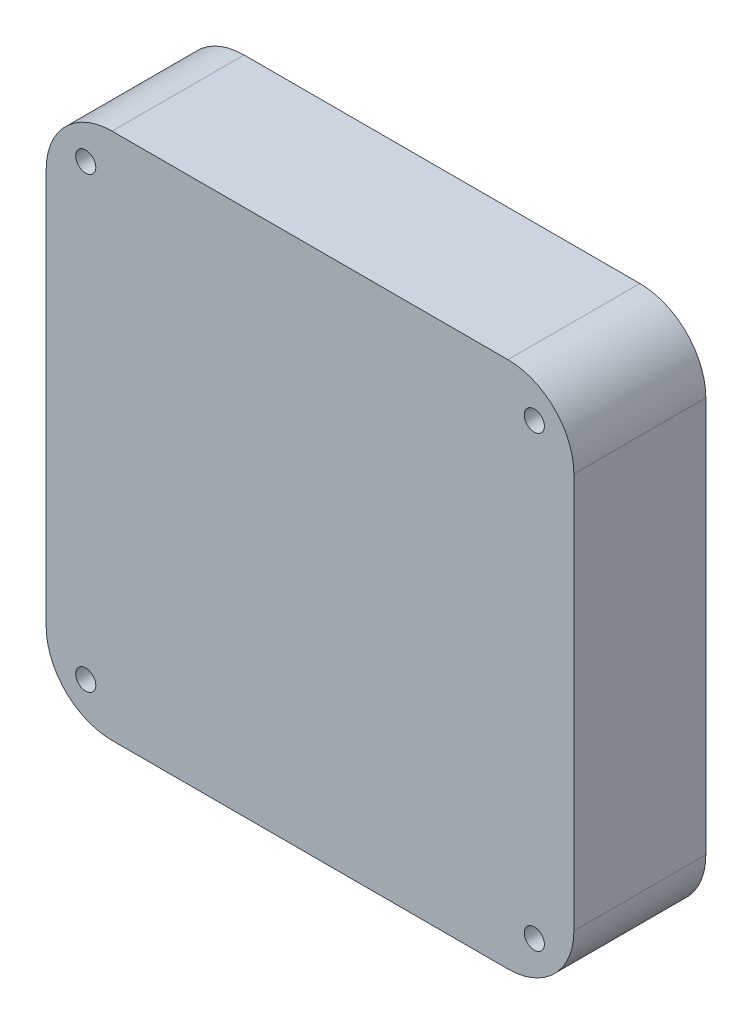
ISO-10303-21;
HEADER;
FILE_DESCRIPTION(('STEP AP214'),'2;1');
FILE_NAME('part.step','',(''),(''),'','','');
FILE_SCHEMA(('AUTOMOTIVE_DESIGN { 1 0 10303 214 1 1 1 1 }'));
ENDSEC;
DATA;
#1=APPLICATION_CONTEXT('core data for automotive mechanical design processes');
#2=APPLICATION_PROTOCOL_DEFINITION('international standard','automotive_design',2000,#1);
#3=PRODUCT_CONTEXT('',#1,'mechanical');
#4=PRODUCT('Part','Part','',(#3));
#5=PRODUCT_RELATED_PRODUCT_CATEGORY('part','',(#4));
#6=PRODUCT_DEFINITION_FORMATION('','',#4);
#7=PRODUCT_DEFINITION_CONTEXT('part definition',#1,'design');
#8=PRODUCT_DEFINITION('design','',#6,#7);
#9=PRODUCT_DEFINITION_SHAPE('','',#8);
#10=(LENGTH_UNIT() NAMED_UNIT(*) SI_UNIT(.MILLI.,.METRE.));
#11=(NAMED_UNIT(*) PLANE_ANGLE_UNIT() SI_UNIT($,.RADIAN.));
#12=(NAMED_UNIT(*) SI_UNIT($,.STERADIAN.) SOLID_ANGLE_UNIT());
#13=UNCERTAINTY_MEASURE_WITH_UNIT(LENGTH_MEASURE(1.E-05),#10,'distance_accuracy_value','');
#14=(GEOMETRIC_REPRESENTATION_CONTEXT(3) GLOBAL_UNCERTAINTY_ASSIGNED_CONTEXT((#13)) GLOBAL_UNIT_ASSIGNED_CONTEXT((#10,
#11,#12)) REPRESENTATION_CONTEXT('',''));
#15=CARTESIAN_POINT('',(0.,0.,0.));
#16=DIRECTION('',(0.,0.,1.));
#17=DIRECTION('',(1.,0.,0.));
#18=AXIS2_PLACEMENT_3D('',#15,#16,#17);
#19=CARTESIAN_POINT('',(0.,0.,10.));
#20=DIRECTION('',(1.,0.,0.));
#21=DIRECTION('',(0.,0.,-1.));
#22=AXIS2_PLACEMENT_3D('',#19,#20,#21);
#23=PLANE('',#22);
#24=DIRECTION('',(0.,-1.,0.));
#25=VECTOR('',#24,1.);
#26=CARTESIAN_POINT('',(0.,0.,0.));
#27=LINE('',#26,#25);
#28=CARTESIAN_POINT('',(0.,35.,0.));
#29=VERTEX_POINT('',#28);
#30=CARTESIAN_POINT('',(0.,5.,0.));
#31=VERTEX_POINT('',#30);
#32=EDGE_CURVE('E160',#29,#31,#27,.T.);
#33=ORIENTED_EDGE('',*,*,#32,.T.);
#34=DIRECTION('',(0.,0.,-1.));
#35=VECTOR('',#34,1.);
#36=CARTESIAN_POINT('',(0.,5.,10.));
#37=LINE('',#36,#35);
#38=CARTESIAN_POINT('',(0.,5.,10.));
#39=VERTEX_POINT('',#38);
#40=EDGE_CURVE('E11',#31,#39,#37,.F.);
#41=ORIENTED_EDGE('',*,*,#40,.T.);
#42=DIRECTION('',(0.,-1.,0.));
#43=VECTOR('',#42,1.);
#44=CARTESIAN_POINT('',(0.,0.,10.));
#45=LINE('',#44,#43);
#46=CARTESIAN_POINT('',(0.,35.,10.));
#47=VERTEX_POINT('',#46);
#48=EDGE_CURVE('E128',#47,#39,#45,.T.);
#49=ORIENTED_EDGE('',*,*,#48,.F.);
#50=DIRECTION('',(0.,0.,-1.));
#51=VECTOR('',#50,1.);
#52=CARTESIAN_POINT('',(0.,35.,10.));
#53=LINE('',#52,#51);
#54=EDGE_CURVE('E44',#47,#29,#53,.T.);
#55=ORIENTED_EDGE('',*,*,#54,.T.);
#56=EDGE_LOOP('',(#33,#41,#49,#55));
#57=FACE_BOUND('',#56,.T.);
#58=ADVANCED_FACE('F36',(#57),#23,.F.);
#59=CARTESIAN_POINT('',(0.,0.,10.));
#60=DIRECTION('',(0.,1.,0.));
#61=DIRECTION('',(0.,0.,1.));
#62=AXIS2_PLACEMENT_3D('',#59,#60,#61);
#63=PLANE('',#62);
#64=DIRECTION('',(1.,0.,0.));
#65=VECTOR('',#64,1.);
#66=CARTESIAN_POINT('',(0.,0.,0.));
#67=LINE('',#66,#65);
#68=CARTESIAN_POINT('',(5.,0.,0.));
#69=VERTEX_POINT('',#68);
#70=CARTESIAN_POINT('',(35.,0.,0.));
#71=VERTEX_POINT('',#70);
#72=EDGE_CURVE('E133',#69,#71,#67,.T.);
#73=ORIENTED_EDGE('',*,*,#72,.T.);
#74=DIRECTION('',(0.,0.,-1.));
#75=VECTOR('',#74,1.);
#76=CARTESIAN_POINT('',(35.,0.,10.));
#77=LINE('',#76,#75);
#78=CARTESIAN_POINT('',(35.,0.,10.));
#79=VERTEX_POINT('',#78);
#80=EDGE_CURVE('E51',#71,#79,#77,.F.);
#81=ORIENTED_EDGE('',*,*,#80,.T.);
#82=DIRECTION('',(1.,0.,0.));
#83=VECTOR('',#82,1.);
#84=CARTESIAN_POINT('',(0.,0.,10.));
#85=LINE('',#84,#83);
#86=CARTESIAN_POINT('',(5.,0.,10.));
#87=VERTEX_POINT('',#86);
#88=EDGE_CURVE('E131',#87,#79,#85,.T.);
#89=ORIENTED_EDGE('',*,*,#88,.F.);
#90=DIRECTION('',(0.,0.,-1.));
#91=VECTOR('',#90,1.);
#92=CARTESIAN_POINT('',(5.,0.,10.));
#93=LINE('',#92,#91);
#94=EDGE_CURVE('E152',#87,#69,#93,.T.);
#95=ORIENTED_EDGE('',*,*,#94,.T.);
#96=EDGE_LOOP('',(#73,#81,#89,#95));
#97=FACE_BOUND('',#96,.T.);
#98=ADVANCED_FACE('F215',(#97),#63,.F.);
#99=CARTESIAN_POINT('',(40.,0.,10.));
#100=DIRECTION('',(-1.,0.,0.));
#101=DIRECTION('',(0.,0.,1.));
#102=AXIS2_PLACEMENT_3D('',#99,#100,#101);
#103=PLANE('',#102);
#104=DIRECTION('',(0.,1.,0.));
#105=VECTOR('',#104,1.);
#106=CARTESIAN_POINT('',(40.,0.,0.));
#107=LINE('',#106,#105);
#108=CARTESIAN_POINT('',(40.,5.,0.));
#109=VERTEX_POINT('',#108);
#110=CARTESIAN_POINT('',(40.,35.,0.));
#111=VERTEX_POINT('',#110);
#112=EDGE_CURVE('E129',#109,#111,#107,.T.);
#113=ORIENTED_EDGE('',*,*,#112,.T.);
#114=DIRECTION('',(0.,0.,-1.));
#115=VECTOR('',#114,1.);
#116=CARTESIAN_POINT('',(40.,35.,10.));
#117=LINE('',#116,#115);
#118=CARTESIAN_POINT('',(40.,35.,10.));
#119=VERTEX_POINT('',#118);
#120=EDGE_CURVE('E107',#111,#119,#117,.F.);
#121=ORIENTED_EDGE('',*,*,#120,.T.);
#122=DIRECTION('',(0.,1.,0.));
#123=VECTOR('',#122,1.);
#124=CARTESIAN_POINT('',(40.,0.,10.));
#125=LINE('',#124,#123);
#126=CARTESIAN_POINT('',(40.,5.,10.));
#127=VERTEX_POINT('',#126);
#128=EDGE_CURVE('E172',#127,#119,#125,.T.);
#129=ORIENTED_EDGE('',*,*,#128,.F.);
#130=DIRECTION('',(0.,0.,-1.));
#131=VECTOR('',#130,1.);
#132=CARTESIAN_POINT('',(40.,5.,10.));
#133=LINE('',#132,#131);
#134=EDGE_CURVE('E112',#127,#109,#133,.T.);
#135=ORIENTED_EDGE('',*,*,#134,.T.);
#136=EDGE_LOOP('',(#113,#121,#129,#135));
#137=FACE_BOUND('',#136,.T.);
#138=ADVANCED_FACE('F212',(#137),#103,.F.);
#139=CARTESIAN_POINT('',(0.,40.,10.));
#140=DIRECTION('',(0.,-1.,0.));
#141=DIRECTION('',(0.,0.,-1.));
#142=AXIS2_PLACEMENT_3D('',#139,#140,#141);
#143=PLANE('',#142);
#144=DIRECTION('',(-1.,0.,0.));
#145=VECTOR('',#144,1.);
#146=CARTESIAN_POINT('',(0.,40.,10.));
#147=LINE('',#146,#145);
#148=CARTESIAN_POINT('',(35.,40.,10.));
#149=VERTEX_POINT('',#148);
#150=CARTESIAN_POINT('',(5.,40.,10.));
#151=VERTEX_POINT('',#150);
#152=EDGE_CURVE('E122',#149,#151,#147,.T.);
#153=ORIENTED_EDGE('',*,*,#152,.F.);
#154=DIRECTION('',(0.,0.,-1.));
#155=VECTOR('',#154,1.);
#156=CARTESIAN_POINT('',(35.,40.,10.));
#157=LINE('',#156,#155);
#158=CARTESIAN_POINT('',(35.,40.,0.));
#159=VERTEX_POINT('',#158);
#160=EDGE_CURVE('E106',#149,#159,#157,.T.);
#161=ORIENTED_EDGE('',*,*,#160,.T.);
#162=DIRECTION('',(-1.,0.,0.));
#163=VECTOR('',#162,1.);
#164=CARTESIAN_POINT('',(0.,40.,0.));
#165=LINE('',#164,#163);
#166=CARTESIAN_POINT('',(5.,40.,0.));
#167=VERTEX_POINT('',#166);
#168=EDGE_CURVE('E119',#159,#167,#165,.T.);
#169=ORIENTED_EDGE('',*,*,#168,.T.);
#170=DIRECTION('',(0.,0.,-1.));
#171=VECTOR('',#170,1.);
#172=CARTESIAN_POINT('',(5.,40.,10.));
#173=LINE('',#172,#171);
#174=EDGE_CURVE('E124',#167,#151,#173,.F.);
#175=ORIENTED_EDGE('',*,*,#174,.T.);
#176=EDGE_LOOP('',(#153,#161,#169,#175));
#177=FACE_BOUND('',#176,.T.);
#178=ADVANCED_FACE('F118',(#177),#143,.F.);
#179=CARTESIAN_POINT('',(0.,0.,10.));
#180=DIRECTION('',(0.,0.,-1.));
#181=DIRECTION('',(-1.,0.,0.));
#182=AXIS2_PLACEMENT_3D('',#179,#180,#181);
#183=PLANE('',#182);
#184=CARTESIAN_POINT('',(3.,3.,10.));
#185=DIRECTION('',(0.,0.,1.));
#186=DIRECTION('',(1.,0.,0.));
#187=AXIS2_PLACEMENT_3D('',#184,#185,#186);
#188=CIRCLE('',#187,0.761999999999988);
#189=CARTESIAN_POINT('',(3.76199999999999,3.,10.));
#190=VERTEX_POINT('',#189);
#191=EDGE_CURVE('E193',#190,#190,#188,.T.);
#192=ORIENTED_EDGE('',*,*,#191,.F.);
#193=EDGE_LOOP('',(#192));
#194=FACE_BOUND('',#193,.T.);
#195=CARTESIAN_POINT('',(37.,3.,10.));
#196=DIRECTION('',(0.,0.,1.));
#197=DIRECTION('',(1.,0.,0.));
#198=AXIS2_PLACEMENT_3D('',#195,#196,#197);
#199=CIRCLE('',#198,0.761999999999992);
#200=CARTESIAN_POINT('',(37.762,3.,10.));
#201=VERTEX_POINT('',#200);
#202=EDGE_CURVE('E187',#201,#201,#199,.T.);
#203=ORIENTED_EDGE('',*,*,#202,.F.);
#204=EDGE_LOOP('',(#203));
#205=FACE_BOUND('',#204,.T.);
#206=CARTESIAN_POINT('',(37.,37.,10.));
#207=DIRECTION('',(0.,0.,1.));
#208=DIRECTION('',(1.,0.,0.));
#209=AXIS2_PLACEMENT_3D('',#206,#207,#208);
#210=CIRCLE('',#209,0.761999999999992);
#211=CARTESIAN_POINT('',(37.762,37.,10.));
#212=VERTEX_POINT('',#211);
#213=EDGE_CURVE('E181',#212,#212,#210,.T.);
#214=ORIENTED_EDGE('',*,*,#213,.F.);
#215=EDGE_LOOP('',(#214));
#216=FACE_BOUND('',#215,.T.);
#217=CARTESIAN_POINT('',(3.,37.,10.));
#218=DIRECTION('',(0.,0.,1.));
#219=DIRECTION('',(1.,0.,0.));
#220=AXIS2_PLACEMENT_3D('',#217,#218,#219);
#221=CIRCLE('',#220,0.761999999999988);
#222=CARTESIAN_POINT('',(3.76199999999999,37.,10.));
#223=VERTEX_POINT('',#222);
#224=EDGE_CURVE('E168',#223,#223,#221,.T.);
#225=ORIENTED_EDGE('',*,*,#224,.F.);
#226=EDGE_LOOP('',(#225));
#227=FACE_BOUND('',#226,.T.);
#228=ORIENTED_EDGE('',*,*,#128,.T.);
#229=CARTESIAN_POINT('',(35.,35.,10.));
#230=DIRECTION('',(0.,0.,-1.));
#231=DIRECTION('',(-1.,0.,0.));
#232=AXIS2_PLACEMENT_3D('',#229,#230,#231);
#233=CIRCLE('',#232,5.);
#234=EDGE_CURVE('E150',#119,#149,#233,.F.);
#235=ORIENTED_EDGE('',*,*,#234,.T.);
#236=ORIENTED_EDGE('',*,*,#152,.T.);
#237=CARTESIAN_POINT('',(5.,35.,10.));
#238=DIRECTION('',(0.,0.,-1.));
#239=DIRECTION('',(-1.,0.,0.));
#240=AXIS2_PLACEMENT_3D('',#237,#238,#239);
#241=CIRCLE('',#240,5.);
#242=EDGE_CURVE('E145',#151,#47,#241,.F.);
#243=ORIENTED_EDGE('',*,*,#242,.T.);
#244=ORIENTED_EDGE('',*,*,#48,.T.);
#245=CARTESIAN_POINT('',(5.,5.,10.));
#246=DIRECTION('',(0.,0.,-1.));
#247=DIRECTION('',(-1.,0.,0.));
#248=AXIS2_PLACEMENT_3D('',#245,#246,#247);
#249=CIRCLE('',#248,5.);
#250=EDGE_CURVE('E58',#39,#87,#249,.F.);
#251=ORIENTED_EDGE('',*,*,#250,.T.);
#252=ORIENTED_EDGE('',*,*,#88,.T.);
#253=CARTESIAN_POINT('',(35.,5.,10.));
#254=DIRECTION('',(0.,0.,-1.));
#255=DIRECTION('',(-1.,0.,0.));
#256=AXIS2_PLACEMENT_3D('',#253,#254,#255);
#257=CIRCLE('',#256,5.);
#258=EDGE_CURVE('E148',#79,#127,#257,.F.);
#259=ORIENTED_EDGE('',*,*,#258,.T.);
#260=EDGE_LOOP('',(#228,#235,#236,#243,#244,#251,#252,#259));
#261=FACE_BOUND('',#260,.T.);
#262=ADVANCED_FACE('F199',(#194,#205,#216,#227,#261),#183,.F.);
#263=CARTESIAN_POINT('',(0.,0.,0.));
#264=DIRECTION('',(0.,0.,-1.));
#265=DIRECTION('',(-1.,0.,0.));
#266=AXIS2_PLACEMENT_3D('',#263,#264,#265);
#267=PLANE('',#266);
#268=CARTESIAN_POINT('',(3.,3.,0.));
#269=DIRECTION('',(0.,0.,1.));
#270=DIRECTION('',(1.,0.,0.));
#271=AXIS2_PLACEMENT_3D('',#268,#269,#270);
#272=CIRCLE('',#271,0.761999999999986);
#273=CARTESIAN_POINT('',(3.76199999999999,3.,0.));
#274=VERTEX_POINT('',#273);
#275=EDGE_CURVE('E190',#274,#274,#272,.T.);
#276=ORIENTED_EDGE('',*,*,#275,.T.);
#277=EDGE_LOOP('',(#276));
#278=FACE_BOUND('',#277,.T.);
#279=CARTESIAN_POINT('',(37.,3.,0.));
#280=DIRECTION('',(0.,0.,1.));
#281=DIRECTION('',(1.,0.,0.));
#282=AXIS2_PLACEMENT_3D('',#279,#280,#281);
#283=CIRCLE('',#282,0.761999999999985);
#284=CARTESIAN_POINT('',(37.762,3.,0.));
#285=VERTEX_POINT('',#284);
#286=EDGE_CURVE('E184',#285,#285,#283,.T.);
#287=ORIENTED_EDGE('',*,*,#286,.T.);
#288=EDGE_LOOP('',(#287));
#289=FACE_BOUND('',#288,.T.);
#290=CARTESIAN_POINT('',(37.,37.,0.));
#291=DIRECTION('',(0.,0.,1.));
#292=DIRECTION('',(1.,0.,0.));
#293=AXIS2_PLACEMENT_3D('',#290,#291,#292);
#294=CIRCLE('',#293,0.761999999999985);
#295=CARTESIAN_POINT('',(37.762,37.,0.));
#296=VERTEX_POINT('',#295);
#297=EDGE_CURVE('E178',#296,#296,#294,.T.);
#298=ORIENTED_EDGE('',*,*,#297,.T.);
#299=EDGE_LOOP('',(#298));
#300=FACE_BOUND('',#299,.T.);
#301=CARTESIAN_POINT('',(3.,37.,0.));
#302=DIRECTION('',(0.,0.,1.));
#303=DIRECTION('',(1.,0.,0.));
#304=AXIS2_PLACEMENT_3D('',#301,#302,#303);
#305=CIRCLE('',#304,0.761999999999986);
#306=CARTESIAN_POINT('',(3.76199999999999,37.,0.));
#307=VERTEX_POINT('',#306);
#308=EDGE_CURVE('E165',#307,#307,#305,.T.);
#309=ORIENTED_EDGE('',*,*,#308,.T.);
#310=EDGE_LOOP('',(#309));
#311=FACE_BOUND('',#310,.T.);
#312=ORIENTED_EDGE('',*,*,#168,.F.);
#313=CARTESIAN_POINT('',(35.,35.,0.));
#314=DIRECTION('',(0.,0.,-1.));
#315=DIRECTION('',(-1.,0.,0.));
#316=AXIS2_PLACEMENT_3D('',#313,#314,#315);
#317=CIRCLE('',#316,5.);
#318=EDGE_CURVE('E102',#159,#111,#317,.T.);
#319=ORIENTED_EDGE('',*,*,#318,.T.);
#320=ORIENTED_EDGE('',*,*,#112,.F.);
#321=CARTESIAN_POINT('',(35.,5.,0.));
#322=DIRECTION('',(0.,0.,-1.));
#323=DIRECTION('',(-1.,0.,0.));
#324=AXIS2_PLACEMENT_3D('',#321,#322,#323);
#325=CIRCLE('',#324,5.);
#326=EDGE_CURVE('E113',#109,#71,#325,.T.);
#327=ORIENTED_EDGE('',*,*,#326,.T.);
#328=ORIENTED_EDGE('',*,*,#72,.F.);
#329=CARTESIAN_POINT('',(5.,5.,0.));
#330=DIRECTION('',(0.,0.,-1.));
#331=DIRECTION('',(-1.,0.,0.));
#332=AXIS2_PLACEMENT_3D('',#329,#330,#331);
#333=CIRCLE('',#332,5.);
#334=EDGE_CURVE('E139',#69,#31,#333,.T.);
#335=ORIENTED_EDGE('',*,*,#334,.T.);
#336=ORIENTED_EDGE('',*,*,#32,.F.);
#337=CARTESIAN_POINT('',(5.,35.,0.));
#338=DIRECTION('',(0.,0.,-1.));
#339=DIRECTION('',(-1.,0.,0.));
#340=AXIS2_PLACEMENT_3D('',#337,#338,#339);
#341=CIRCLE('',#340,5.);
#342=EDGE_CURVE('E123',#29,#167,#341,.T.);
#343=ORIENTED_EDGE('',*,*,#342,.T.);
#344=EDGE_LOOP('',(#312,#319,#320,#327,#328,#335,#336,#343));
#345=FACE_BOUND('',#344,.T.);
#346=ADVANCED_FACE('F126',(#278,#289,#300,#311,#345),#267,.T.);
#347=CARTESIAN_POINT('',(3.,37.,10.));
#348=DIRECTION('',(0.,0.,1.));
#349=DIRECTION('',(1.,0.,0.));
#350=AXIS2_PLACEMENT_3D('',#347,#348,#349);
#351=CYLINDRICAL_SURFACE('',#350,0.761999999999987);
#352=ORIENTED_EDGE('',*,*,#308,.F.);
#353=EDGE_LOOP('',(#352));
#354=FACE_BOUND('',#353,.T.);
#355=ORIENTED_EDGE('',*,*,#224,.T.);
#356=EDGE_LOOP('',(#355));
#357=FACE_BOUND('',#356,.T.);
#358=ADVANCED_FACE('F281',(#354,#357),#351,.F.);
#359=CARTESIAN_POINT('',(37.,37.,10.));
#360=DIRECTION('',(0.,0.,1.));
#361=DIRECTION('',(1.,0.,0.));
#362=AXIS2_PLACEMENT_3D('',#359,#360,#361);
#363=CYLINDRICAL_SURFACE('',#362,0.761999999999988);
#364=ORIENTED_EDGE('',*,*,#297,.F.);
#365=EDGE_LOOP('',(#364));
#366=FACE_BOUND('',#365,.T.);
#367=ORIENTED_EDGE('',*,*,#213,.T.);
#368=EDGE_LOOP('',(#367));
#369=FACE_BOUND('',#368,.T.);
#370=ADVANCED_FACE('F272',(#366,#369),#363,.F.);
#371=CARTESIAN_POINT('',(37.,3.,10.));
#372=DIRECTION('',(0.,0.,1.));
#373=DIRECTION('',(1.,0.,0.));
#374=AXIS2_PLACEMENT_3D('',#371,#372,#373);
#375=CYLINDRICAL_SURFACE('',#374,0.761999999999988);
#376=ORIENTED_EDGE('',*,*,#286,.F.);
#377=EDGE_LOOP('',(#376));
#378=FACE_BOUND('',#377,.T.);
#379=ORIENTED_EDGE('',*,*,#202,.T.);
#380=EDGE_LOOP('',(#379));
#381=FACE_BOUND('',#380,.T.);
#382=ADVANCED_FACE('F263',(#378,#381),#375,.F.);
#383=CARTESIAN_POINT('',(3.,3.,10.));
#384=DIRECTION('',(0.,0.,1.));
#385=DIRECTION('',(1.,0.,0.));
#386=AXIS2_PLACEMENT_3D('',#383,#384,#385);
#387=CYLINDRICAL_SURFACE('',#386,0.761999999999987);
#388=ORIENTED_EDGE('',*,*,#275,.F.);
#389=EDGE_LOOP('',(#388));
#390=FACE_BOUND('',#389,.T.);
#391=ORIENTED_EDGE('',*,*,#191,.T.);
#392=EDGE_LOOP('',(#391));
#393=FACE_BOUND('',#392,.T.);
#394=ADVANCED_FACE('F197',(#390,#393),#387,.F.);
#395=CARTESIAN_POINT('',(35.,35.,10.));
#396=DIRECTION('',(0.,0.,-1.));
#397=DIRECTION('',(-1.,0.,0.));
#398=AXIS2_PLACEMENT_3D('',#395,#396,#397);
#399=CYLINDRICAL_SURFACE('',#398,5.);
#400=ORIENTED_EDGE('',*,*,#234,.F.);
#401=ORIENTED_EDGE('',*,*,#120,.F.);
#402=ORIENTED_EDGE('',*,*,#318,.F.);
#403=ORIENTED_EDGE('',*,*,#160,.F.);
#404=EDGE_LOOP('',(#400,#401,#402,#403));
#405=FACE_BOUND('',#404,.T.);
#406=ADVANCED_FACE('F105',(#405),#399,.T.);
#407=CARTESIAN_POINT('',(35.,5.,10.));
#408=DIRECTION('',(0.,0.,-1.));
#409=DIRECTION('',(-1.,0.,0.));
#410=AXIS2_PLACEMENT_3D('',#407,#408,#409);
#411=CYLINDRICAL_SURFACE('',#410,5.);
#412=ORIENTED_EDGE('',*,*,#258,.F.);
#413=ORIENTED_EDGE('',*,*,#80,.F.);
#414=ORIENTED_EDGE('',*,*,#326,.F.);
#415=ORIENTED_EDGE('',*,*,#134,.F.);
#416=EDGE_LOOP('',(#412,#413,#414,#415));
#417=FACE_BOUND('',#416,.T.);
#418=ADVANCED_FACE('F214',(#417),#411,.T.);
#419=CARTESIAN_POINT('',(5.,5.,10.));
#420=DIRECTION('',(0.,0.,-1.));
#421=DIRECTION('',(-1.,0.,0.));
#422=AXIS2_PLACEMENT_3D('',#419,#420,#421);
#423=CYLINDRICAL_SURFACE('',#422,5.);
#424=ORIENTED_EDGE('',*,*,#250,.F.);
#425=ORIENTED_EDGE('',*,*,#40,.F.);
#426=ORIENTED_EDGE('',*,*,#334,.F.);
#427=ORIENTED_EDGE('',*,*,#94,.F.);
#428=EDGE_LOOP('',(#424,#425,#426,#427));
#429=FACE_BOUND('',#428,.T.);
#430=ADVANCED_FACE('F218',(#429),#423,.T.);
#431=CARTESIAN_POINT('',(5.,35.,10.));
#432=DIRECTION('',(0.,0.,-1.));
#433=DIRECTION('',(-1.,0.,0.));
#434=AXIS2_PLACEMENT_3D('',#431,#432,#433);
#435=CYLINDRICAL_SURFACE('',#434,5.);
#436=ORIENTED_EDGE('',*,*,#242,.F.);
#437=ORIENTED_EDGE('',*,*,#174,.F.);
#438=ORIENTED_EDGE('',*,*,#342,.F.);
#439=ORIENTED_EDGE('',*,*,#54,.F.);
#440=EDGE_LOOP('',(#436,#437,#438,#439));
#441=FACE_BOUND('',#440,.T.);
#442=ADVANCED_FACE('F38',(#441),#435,.T.);
#443=CLOSED_SHELL('',(#58,#98,#138,#178,#262,#346,#358,#370,#382,#394,#406,#418,#430,#442));
#444=MANIFOLD_SOLID_BREP('B2',#443);
#445=ADVANCED_BREP_SHAPE_REPRESENTATION('',(#18,#444),#14);
#446=SHAPE_DEFINITION_REPRESENTATION(#9,#445);
ENDSEC;
END-ISO-10303-21;
